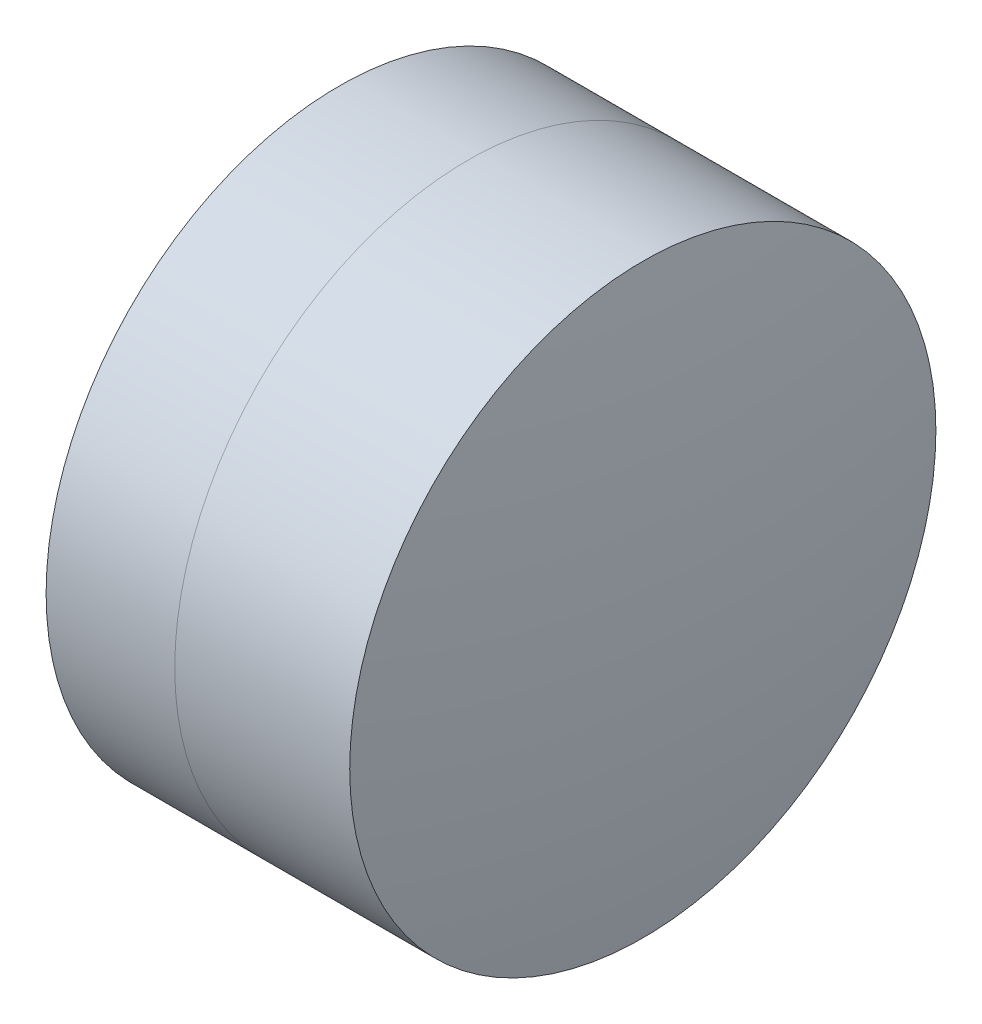
ISO-10303-21;
HEADER;
FILE_DESCRIPTION(('STEP AP214'),'2;1');
FILE_NAME('part.step','',(''),(''),'','','');
FILE_SCHEMA(('AUTOMOTIVE_DESIGN { 1 0 10303 214 1 1 1 1 }'));
ENDSEC;
DATA;
#1=APPLICATION_CONTEXT('core data for automotive mechanical design processes');
#2=APPLICATION_PROTOCOL_DEFINITION('international standard','automotive_design',2000,#1);
#3=PRODUCT_CONTEXT('',#1,'mechanical');
#4=PRODUCT('Part','Part','',(#3));
#5=PRODUCT_RELATED_PRODUCT_CATEGORY('part','',(#4));
#6=PRODUCT_DEFINITION_FORMATION('','',#4);
#7=PRODUCT_DEFINITION_CONTEXT('part definition',#1,'design');
#8=PRODUCT_DEFINITION('design','',#6,#7);
#9=PRODUCT_DEFINITION_SHAPE('','',#8);
#10=(LENGTH_UNIT() NAMED_UNIT(*) SI_UNIT(.MILLI.,.METRE.));
#11=(NAMED_UNIT(*) PLANE_ANGLE_UNIT() SI_UNIT($,.RADIAN.));
#12=(NAMED_UNIT(*) SI_UNIT($,.STERADIAN.) SOLID_ANGLE_UNIT());
#13=UNCERTAINTY_MEASURE_WITH_UNIT(LENGTH_MEASURE(1.E-05),#10,'distance_accuracy_value','');
#14=(GEOMETRIC_REPRESENTATION_CONTEXT(3) GLOBAL_UNCERTAINTY_ASSIGNED_CONTEXT((#13)) GLOBAL_UNIT_ASSIGNED_CONTEXT((#10,
#11,#12)) REPRESENTATION_CONTEXT('',''));
#15=CARTESIAN_POINT('',(0.,0.,0.));
#16=DIRECTION('',(0.,0.,1.));
#17=DIRECTION('',(1.,0.,0.));
#18=AXIS2_PLACEMENT_3D('',#15,#16,#17);
#19=CARTESIAN_POINT('',(1.09460433993269,0.,0.));
#20=DIRECTION('',(-1.,0.,0.));
#21=DIRECTION('',(0.,0.,1.));
#22=AXIS2_PLACEMENT_3D('',#19,#20,#21);
#23=SPHERICAL_SURFACE('',#22,7.188);
#24=CARTESIAN_POINT('',(7.55562933601496,0.,0.));
#25=DIRECTION('',(-1.,0.,0.));
#26=DIRECTION('',(0.,0.,1.));
#27=AXIS2_PLACEMENT_3D('',#24,#25,#26);
#28=CIRCLE('',#27,3.15);
#29=CARTESIAN_POINT('',(7.55562933601496,0.,3.15));
#30=VERTEX_POINT('',#29);
#31=EDGE_CURVE('E11',#30,#30,#28,.T.);
#32=ORIENTED_EDGE('',*,*,#31,.T.);
#33=EDGE_LOOP('',(#32));
#34=FACE_BOUND('',#33,.T.);
#35=ADVANCED_FACE('F45',(#34),#23,.F.);
#36=CARTESIAN_POINT('',(-0.551919992657797,0.,0.));
#37=DIRECTION('',(-1.,0.,0.));
#38=DIRECTION('',(0.,0.,1.));
#39=AXIS2_PLACEMENT_3D('',#36,#37,#38);
#40=CYLINDRICAL_SURFACE('',#39,3.15);
#41=CARTESIAN_POINT('',(9.43627643236142,0.,0.));
#42=DIRECTION('',(-1.,0.,0.));
#43=DIRECTION('',(0.,0.,1.));
#44=AXIS2_PLACEMENT_3D('',#41,#42,#43);
#45=CIRCLE('',#44,3.15);
#46=CARTESIAN_POINT('',(9.43627643236142,0.,3.15));
#47=VERTEX_POINT('',#46);
#48=EDGE_CURVE('E51',#47,#47,#45,.T.);
#49=ORIENTED_EDGE('',*,*,#48,.T.);
#50=EDGE_LOOP('',(#49));
#51=FACE_BOUND('',#50,.T.);
#52=ORIENTED_EDGE('',*,*,#31,.F.);
#53=EDGE_LOOP('',(#52));
#54=FACE_BOUND('',#53,.T.);
#55=ADVANCED_FACE('F57',(#51,#54),#40,.T.);
#56=CARTESIAN_POINT('',(-10.5813956600673,0.,0.));
#57=DIRECTION('',(-1.,0.,0.));
#58=DIRECTION('',(0.,0.,1.));
#59=AXIS2_PLACEMENT_3D('',#56,#57,#58);
#60=SPHERICAL_SURFACE('',#59,20.264);
#61=ORIENTED_EDGE('',*,*,#48,.F.);
#62=EDGE_LOOP('',(#61));
#63=FACE_BOUND('',#62,.T.);
#64=ADVANCED_FACE('F60',(#63),#60,.T.);
#65=CLOSED_SHELL('',(#35,#55,#64));
#66=MANIFOLD_SOLID_BREP('B2',#65);
#67=CARTESIAN_POINT('',(16.0426043399327,0.,0.));
#68=DIRECTION('',(-1.,0.,0.));
#69=DIRECTION('',(0.,0.,-1.));
#70=AXIS2_PLACEMENT_3D('',#67,#68,#69);
#71=SPHERICAL_SURFACE('',#70,10.36);
#72=CARTESIAN_POINT('',(6.17310080631966,0.,0.));
#73=DIRECTION('',(-1.,0.,0.));
#74=DIRECTION('',(0.,0.,1.));
#75=AXIS2_PLACEMENT_3D('',#72,#73,#74);
#76=CIRCLE('',#75,3.15);
#77=CARTESIAN_POINT('',(6.17310080631966,0.,3.15));
#78=VERTEX_POINT('',#77);
#79=EDGE_CURVE('E44',#78,#78,#76,.T.);
#80=ORIENTED_EDGE('',*,*,#79,.T.);
#81=EDGE_LOOP('',(#80));
#82=FACE_BOUND('',#81,.T.);
#83=ADVANCED_FACE('F86',(#82),#71,.T.);
#84=CARTESIAN_POINT('',(-0.816062176165804,0.,0.));
#85=DIRECTION('',(-1.,0.,0.));
#86=DIRECTION('',(0.,0.,1.));
#87=AXIS2_PLACEMENT_3D('',#84,#85,#86);
#88=CYLINDRICAL_SURFACE('',#87,3.15);
#89=CARTESIAN_POINT('',(7.55562933601496,0.,0.));
#90=DIRECTION('',(-1.,0.,0.));
#91=DIRECTION('',(0.,0.,1.));
#92=AXIS2_PLACEMENT_3D('',#89,#90,#91);
#93=CIRCLE('',#92,3.15);
#94=CARTESIAN_POINT('',(7.55562933601496,0.,3.15));
#95=VERTEX_POINT('',#94);
#96=EDGE_CURVE('E92',#95,#95,#93,.T.);
#97=ORIENTED_EDGE('',*,*,#96,.T.);
#98=EDGE_LOOP('',(#97));
#99=FACE_BOUND('',#98,.T.);
#100=ORIENTED_EDGE('',*,*,#79,.F.);
#101=EDGE_LOOP('',(#100));
#102=FACE_BOUND('',#101,.T.);
#103=ADVANCED_FACE('F98',(#99,#102),#88,.T.);
#104=CARTESIAN_POINT('',(1.09460433993269,0.,0.));
#105=DIRECTION('',(-1.,0.,0.));
#106=DIRECTION('',(0.,0.,1.));
#107=AXIS2_PLACEMENT_3D('',#104,#105,#106);
#108=SPHERICAL_SURFACE('',#107,7.188);
#109=ORIENTED_EDGE('',*,*,#96,.F.);
#110=EDGE_LOOP('',(#109));
#111=FACE_BOUND('',#110,.T.);
#112=ADVANCED_FACE('F101',(#111),#108,.T.);
#113=CLOSED_SHELL('',(#83,#103,#112));
#114=MANIFOLD_SOLID_BREP('B6',#113);
#115=ADVANCED_BREP_SHAPE_REPRESENTATION('',(#18,#66,#114),#14);
#116=SHAPE_DEFINITION_REPRESENTATION(#9,#115);
ENDSEC;
END-ISO-10303-21;
